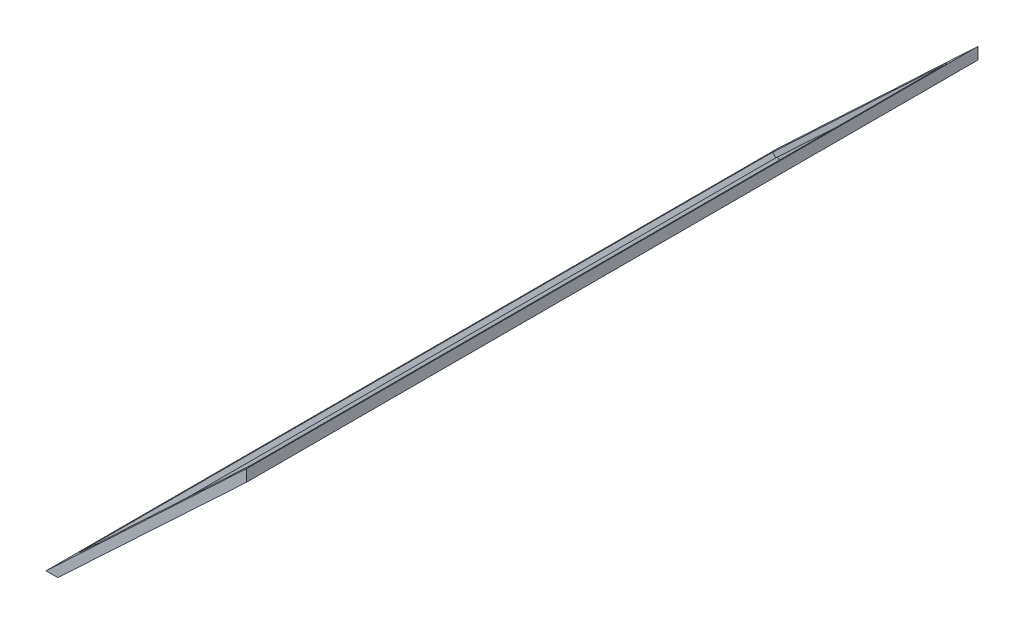
ISO-10303-21;
HEADER;
FILE_DESCRIPTION(('STEP AP214'),'2;1');
FILE_NAME('part.step','',(''),(''),'','','');
FILE_SCHEMA(('AUTOMOTIVE_DESIGN { 1 0 10303 214 1 1 1 1 }'));
ENDSEC;
DATA;
#1=APPLICATION_CONTEXT('core data for automotive mechanical design processes');
#2=APPLICATION_PROTOCOL_DEFINITION('international standard','automotive_design',2000,#1);
#3=PRODUCT_CONTEXT('',#1,'mechanical');
#4=PRODUCT('Part','Part','',(#3));
#5=PRODUCT_RELATED_PRODUCT_CATEGORY('part','',(#4));
#6=PRODUCT_DEFINITION_FORMATION('','',#4);
#7=PRODUCT_DEFINITION_CONTEXT('part definition',#1,'design');
#8=PRODUCT_DEFINITION('design','',#6,#7);
#9=PRODUCT_DEFINITION_SHAPE('','',#8);
#10=(LENGTH_UNIT() NAMED_UNIT(*) SI_UNIT(.MILLI.,.METRE.));
#11=(NAMED_UNIT(*) PLANE_ANGLE_UNIT() SI_UNIT($,.RADIAN.));
#12=(NAMED_UNIT(*) SI_UNIT($,.STERADIAN.) SOLID_ANGLE_UNIT());
#13=UNCERTAINTY_MEASURE_WITH_UNIT(LENGTH_MEASURE(1.E-05),#10,'distance_accuracy_value','');
#14=(GEOMETRIC_REPRESENTATION_CONTEXT(3) GLOBAL_UNCERTAINTY_ASSIGNED_CONTEXT((#13)) GLOBAL_UNIT_ASSIGNED_CONTEXT((#10,
#11,#12)) REPRESENTATION_CONTEXT('',''));
#15=CARTESIAN_POINT('',(0.,0.,0.));
#16=DIRECTION('',(0.,0.,1.));
#17=DIRECTION('',(1.,0.,0.));
#18=AXIS2_PLACEMENT_3D('',#15,#16,#17);
#19=CARTESIAN_POINT('',(0.,0.,620.));
#20=DIRECTION('',(0.,1.,0.));
#21=DIRECTION('',(-1.,0.,0.));
#22=AXIS2_PLACEMENT_3D('',#19,#20,#21);
#23=PLANE('',#22);
#24=DIRECTION('',(1.,0.,0.));
#25=VECTOR('',#24,1.);
#26=CARTESIAN_POINT('',(0.,0.,0.));
#27=LINE('',#26,#25);
#28=CARTESIAN_POINT('',(-10.,0.,0.));
#29=VERTEX_POINT('',#28);
#30=CARTESIAN_POINT('',(0.,0.,0.));
#31=VERTEX_POINT('',#30);
#32=EDGE_CURVE('E180',#29,#31,#27,.T.);
#33=ORIENTED_EDGE('',*,*,#32,.T.);
#34=DIRECTION('',(0.,0.,-1.));
#35=VECTOR('',#34,1.);
#36=CARTESIAN_POINT('',(0.,0.,620.));
#37=LINE('',#36,#35);
#38=CARTESIAN_POINT('',(0.,0.,620.));
#39=VERTEX_POINT('',#38);
#40=EDGE_CURVE('E40',#39,#31,#37,.T.);
#41=ORIENTED_EDGE('',*,*,#40,.F.);
#42=DIRECTION('',(1.,0.,0.));
#43=VECTOR('',#42,1.);
#44=CARTESIAN_POINT('',(0.,0.,620.));
#45=LINE('',#44,#43);
#46=CARTESIAN_POINT('',(-10.,0.,620.));
#47=VERTEX_POINT('',#46);
#48=EDGE_CURVE('E186',#47,#39,#45,.T.);
#49=ORIENTED_EDGE('',*,*,#48,.F.);
#50=DIRECTION('',(0.,0.,-1.));
#51=VECTOR('',#50,1.);
#52=CARTESIAN_POINT('',(-10.,0.,620.));
#53=LINE('',#52,#51);
#54=EDGE_CURVE('E196',#47,#29,#53,.T.);
#55=ORIENTED_EDGE('',*,*,#54,.T.);
#56=EDGE_LOOP('',(#33,#41,#49,#55));
#57=FACE_BOUND('',#56,.T.);
#58=ADVANCED_FACE('F33',(#57),#23,.F.);
#59=CARTESIAN_POINT('',(0.,0.,620.));
#60=DIRECTION('',(-0.68394112888133,0.729537204140085,0.));
#61=DIRECTION('',(-0.729537204140085,-0.68394112888133,0.));
#62=AXIS2_PLACEMENT_3D('',#59,#60,#61);
#63=PLANE('',#62);
#64=DIRECTION('',(-0.729537204140085,-0.68394112888133,0.));
#65=VECTOR('',#64,1.);
#66=CARTESIAN_POINT('',(157.694232948204,147.838343388941,610.));
#67=LINE('',#66,#65);
#68=CARTESIAN_POINT('',(157.694232948204,147.838343388941,610.));
#69=VERTEX_POINT('',#68);
#70=CARTESIAN_POINT('',(1.97312671915553,1.84980629920831,610.));
#71=VERTEX_POINT('',#70);
#72=EDGE_CURVE('E149',#69,#71,#67,.T.);
#73=ORIENTED_EDGE('',*,*,#72,.F.);
#74=DIRECTION('',(0.,0.,1.));
#75=VECTOR('',#74,1.);
#76=CARTESIAN_POINT('',(157.694232948204,147.838343388941,610.));
#77=LINE('',#76,#75);
#78=CARTESIAN_POINT('',(157.694232948204,147.838343388941,10.));
#79=VERTEX_POINT('',#78);
#80=EDGE_CURVE('E47',#79,#69,#77,.T.);
#81=ORIENTED_EDGE('',*,*,#80,.F.);
#82=DIRECTION('',(0.729537204140085,0.68394112888133,0.));
#83=VECTOR('',#82,1.);
#84=CARTESIAN_POINT('',(157.694232948204,147.838343388941,10.));
#85=LINE('',#84,#83);
#86=CARTESIAN_POINT('',(1.97312671915554,1.84980629920832,10.));
#87=VERTEX_POINT('',#86);
#88=EDGE_CURVE('E140',#87,#79,#85,.T.);
#89=ORIENTED_EDGE('',*,*,#88,.F.);
#90=DIRECTION('',(0.,0.,-1.));
#91=VECTOR('',#90,1.);
#92=CARTESIAN_POINT('',(1.97312671915553,1.84980629920831,610.));
#93=LINE('',#92,#91);
#94=EDGE_CURVE('E143',#71,#87,#93,.T.);
#95=ORIENTED_EDGE('',*,*,#94,.F.);
#96=EDGE_LOOP('',(#73,#81,#89,#95));
#97=FACE_BOUND('',#96,.T.);
#98=DIRECTION('',(0.729537204140085,0.68394112888133,0.));
#99=VECTOR('',#98,1.);
#100=CARTESIAN_POINT('',(0.,0.,0.));
#101=LINE('',#100,#99);
#102=CARTESIAN_POINT('',(160.,150.,0.));
#103=VERTEX_POINT('',#102);
#104=EDGE_CURVE('E199',#31,#103,#101,.T.);
#105=ORIENTED_EDGE('',*,*,#104,.T.);
#106=DIRECTION('',(0.,0.,-1.));
#107=VECTOR('',#106,1.);
#108=CARTESIAN_POINT('',(160.,150.,620.));
#109=LINE('',#108,#107);
#110=CARTESIAN_POINT('',(160.,150.,620.));
#111=VERTEX_POINT('',#110);
#112=EDGE_CURVE('E209',#111,#103,#109,.T.);
#113=ORIENTED_EDGE('',*,*,#112,.F.);
#114=DIRECTION('',(0.729537204140085,0.68394112888133,0.));
#115=VECTOR('',#114,1.);
#116=CARTESIAN_POINT('',(0.,0.,620.));
#117=LINE('',#116,#115);
#118=EDGE_CURVE('E189',#39,#111,#117,.T.);
#119=ORIENTED_EDGE('',*,*,#118,.F.);
#120=ORIENTED_EDGE('',*,*,#40,.T.);
#121=EDGE_LOOP('',(#105,#113,#119,#120));
#122=FACE_BOUND('',#121,.T.);
#123=ADVANCED_FACE('F214',(#97,#122),#63,.F.);
#124=CARTESIAN_POINT('',(160.,150.,620.));
#125=DIRECTION('',(-1.,0.,0.));
#126=DIRECTION('',(0.,0.,1.));
#127=AXIS2_PLACEMENT_3D('',#124,#125,#126);
#128=PLANE('',#127);
#129=DIRECTION('',(0.,1.,0.));
#130=VECTOR('',#129,1.);
#131=CARTESIAN_POINT('',(160.,150.,0.));
#132=LINE('',#131,#130);
#133=CARTESIAN_POINT('',(160.,160.,0.));
#134=VERTEX_POINT('',#133);
#135=EDGE_CURVE('E201',#103,#134,#132,.T.);
#136=ORIENTED_EDGE('',*,*,#135,.T.);
#137=DIRECTION('',(0.,0.,-1.));
#138=VECTOR('',#137,1.);
#139=CARTESIAN_POINT('',(160.,160.,620.));
#140=LINE('',#139,#138);
#141=CARTESIAN_POINT('',(160.,160.,620.));
#142=VERTEX_POINT('',#141);
#143=EDGE_CURVE('E206',#142,#134,#140,.T.);
#144=ORIENTED_EDGE('',*,*,#143,.F.);
#145=DIRECTION('',(0.,1.,0.));
#146=VECTOR('',#145,1.);
#147=CARTESIAN_POINT('',(160.,150.,620.));
#148=LINE('',#147,#146);
#149=EDGE_CURVE('E192',#111,#142,#148,.T.);
#150=ORIENTED_EDGE('',*,*,#149,.F.);
#151=ORIENTED_EDGE('',*,*,#112,.T.);
#152=EDGE_LOOP('',(#136,#144,#150,#151));
#153=FACE_BOUND('',#152,.T.);
#154=ADVANCED_FACE('F226',(#153),#128,.F.);
#155=CARTESIAN_POINT('',(-10.,0.,620.));
#156=DIRECTION('',(0.685364699004991,-0.728199992692803,0.));
#157=DIRECTION('',(0.728199992692803,0.685364699004991,0.));
#158=AXIS2_PLACEMENT_3D('',#155,#156,#157);
#159=PLANE('',#158);
#160=DIRECTION('',(-0.728199992692803,-0.685364699004991,0.));
#161=VECTOR('',#160,1.);
#162=CARTESIAN_POINT('',(149.077000109608,149.719529514925,15.));
#163=LINE('',#162,#161);
#164=CARTESIAN_POINT('',(149.077000109608,149.719529514925,15.));
#165=VERTEX_POINT('',#164);
#166=CARTESIAN_POINT('',(0.922999890392041,10.2804704850749,15.));
#167=VERTEX_POINT('',#166);
#168=EDGE_CURVE('E168',#165,#167,#163,.T.);
#169=ORIENTED_EDGE('',*,*,#168,.F.);
#170=DIRECTION('',(0.,0.,-1.));
#171=VECTOR('',#170,1.);
#172=CARTESIAN_POINT('',(149.077000109608,149.719529514925,605.));
#173=LINE('',#172,#171);
#174=CARTESIAN_POINT('',(149.077000109608,149.719529514925,605.));
#175=VERTEX_POINT('',#174);
#176=EDGE_CURVE('E165',#175,#165,#173,.T.);
#177=ORIENTED_EDGE('',*,*,#176,.F.);
#178=DIRECTION('',(0.728199992692803,0.685364699004991,0.));
#179=VECTOR('',#178,1.);
#180=CARTESIAN_POINT('',(149.077000109608,149.719529514925,605.));
#181=LINE('',#180,#179);
#182=CARTESIAN_POINT('',(0.922999890392039,10.2804704850749,605.));
#183=VERTEX_POINT('',#182);
#184=EDGE_CURVE('E174',#183,#175,#181,.T.);
#185=ORIENTED_EDGE('',*,*,#184,.F.);
#186=DIRECTION('',(0.,0.,1.));
#187=VECTOR('',#186,1.);
#188=CARTESIAN_POINT('',(0.922999890392039,10.2804704850749,605.));
#189=LINE('',#188,#187);
#190=EDGE_CURVE('E171',#167,#183,#189,.T.);
#191=ORIENTED_EDGE('',*,*,#190,.F.);
#192=EDGE_LOOP('',(#169,#177,#185,#191));
#193=FACE_BOUND('',#192,.T.);
#194=DIRECTION('',(-0.728199992692803,-0.685364699004991,0.));
#195=VECTOR('',#194,1.);
#196=CARTESIAN_POINT('',(-10.,0.,0.));
#197=LINE('',#196,#195);
#198=EDGE_CURVE('E190',#134,#29,#197,.T.);
#199=ORIENTED_EDGE('',*,*,#198,.T.);
#200=ORIENTED_EDGE('',*,*,#54,.F.);
#201=DIRECTION('',(-0.728199992692803,-0.685364699004991,0.));
#202=VECTOR('',#201,1.);
#203=CARTESIAN_POINT('',(-10.,0.,620.));
#204=LINE('',#203,#202);
#205=EDGE_CURVE('E194',#142,#47,#204,.T.);
#206=ORIENTED_EDGE('',*,*,#205,.F.);
#207=ORIENTED_EDGE('',*,*,#143,.T.);
#208=EDGE_LOOP('',(#199,#200,#206,#207));
#209=FACE_BOUND('',#208,.T.);
#210=ADVANCED_FACE('F230',(#193,#209),#159,.F.);
#211=CARTESIAN_POINT('',(0.,0.,620.));
#212=DIRECTION('',(0.,0.,-1.));
#213=DIRECTION('',(-1.,0.,0.));
#214=AXIS2_PLACEMENT_3D('',#211,#212,#213);
#215=PLANE('',#214);
#216=ORIENTED_EDGE('',*,*,#48,.T.);
#217=ORIENTED_EDGE('',*,*,#118,.T.);
#218=ORIENTED_EDGE('',*,*,#149,.T.);
#219=ORIENTED_EDGE('',*,*,#205,.T.);
#220=EDGE_LOOP('',(#216,#217,#218,#219));
#221=FACE_BOUND('',#220,.T.);
#222=ADVANCED_FACE('F232',(#221),#215,.F.);
#223=CARTESIAN_POINT('',(0.,0.,0.));
#224=DIRECTION('',(0.,0.,-1.));
#225=DIRECTION('',(-1.,0.,0.));
#226=AXIS2_PLACEMENT_3D('',#223,#224,#225);
#227=PLANE('',#226);
#228=ORIENTED_EDGE('',*,*,#32,.F.);
#229=ORIENTED_EDGE('',*,*,#198,.F.);
#230=ORIENTED_EDGE('',*,*,#135,.F.);
#231=ORIENTED_EDGE('',*,*,#104,.F.);
#232=EDGE_LOOP('',(#228,#229,#230,#231));
#233=FACE_BOUND('',#232,.T.);
#234=ADVANCED_FACE('F222',(#233),#227,.T.);
#235=CARTESIAN_POINT('',(228.930211118782,64.8754928176775,605.));
#236=DIRECTION('',(0.728199992692803,0.685364699004991,0.));
#237=DIRECTION('',(-0.685364699004991,0.728199992692803,0.));
#238=AXIS2_PLACEMENT_3D('',#235,#236,#237);
#239=PLANE('',#238);
#240=DIRECTION('',(-0.685364699004991,0.728199992692803,0.));
#241=VECTOR('',#240,1.);
#242=CARTESIAN_POINT('',(228.930211118782,64.8754928176775,15.));
#243=LINE('',#242,#241);
#244=CARTESIAN_POINT('',(152.000823046992,146.612967643954,15.));
#245=VERTEX_POINT('',#244);
#246=EDGE_CURVE('E177',#245,#165,#243,.T.);
#247=ORIENTED_EDGE('',*,*,#246,.F.);
#248=DIRECTION('',(0.,0.,1.));
#249=VECTOR('',#248,1.);
#250=CARTESIAN_POINT('',(152.000823046992,146.612967643954,605.));
#251=LINE('',#250,#249);
#252=CARTESIAN_POINT('',(152.000823046992,146.612967643954,605.));
#253=VERTEX_POINT('',#252);
#254=EDGE_CURVE('E55',#245,#253,#251,.T.);
#255=ORIENTED_EDGE('',*,*,#254,.T.);
#256=DIRECTION('',(-0.685364699004991,0.728199992692803,0.));
#257=VECTOR('',#256,1.);
#258=CARTESIAN_POINT('',(228.930211118782,64.8754928176775,605.));
#259=LINE('',#258,#257);
#260=EDGE_CURVE('E178',#253,#175,#259,.T.);
#261=ORIENTED_EDGE('',*,*,#260,.T.);
#262=ORIENTED_EDGE('',*,*,#176,.T.);
#263=EDGE_LOOP('',(#247,#255,#261,#262));
#264=FACE_BOUND('',#263,.T.);
#265=ADVANCED_FACE('F239',(#264),#239,.F.);
#266=CARTESIAN_POINT('',(228.930211118782,64.8754928176775,605.));
#267=DIRECTION('',(0.,0.,1.));
#268=DIRECTION('',(1.,0.,0.));
#269=AXIS2_PLACEMENT_3D('',#266,#267,#268);
#270=PLANE('',#269);
#271=ORIENTED_EDGE('',*,*,#260,.F.);
#272=DIRECTION('',(-0.729537204140085,-0.68394112888133,0.));
#273=VECTOR('',#272,1.);
#274=CARTESIAN_POINT('',(152.16075940473,146.762907979333,605.));
#275=LINE('',#274,#273);
#276=CARTESIAN_POINT('',(3.57448091560872,7.46327189578214,605.));
#277=VERTEX_POINT('',#276);
#278=EDGE_CURVE('E161',#253,#277,#275,.T.);
#279=ORIENTED_EDGE('',*,*,#278,.T.);
#280=DIRECTION('',(-0.685364699004991,0.728199992692803,0.));
#281=VECTOR('',#280,1.);
#282=CARTESIAN_POINT('',(80.7762108995664,-74.5635662121729,605.));
#283=LINE('',#282,#281);
#284=EDGE_CURVE('E181',#277,#183,#283,.T.);
#285=ORIENTED_EDGE('',*,*,#284,.T.);
#286=ORIENTED_EDGE('',*,*,#184,.T.);
#287=EDGE_LOOP('',(#271,#279,#285,#286));
#288=FACE_BOUND('',#287,.T.);
#289=ADVANCED_FACE('F271',(#288),#270,.F.);
#290=CARTESIAN_POINT('',(80.7762108995664,-74.5635662121729,605.));
#291=DIRECTION('',(-0.728199992692803,-0.685364699004991,0.));
#292=DIRECTION('',(0.685364699004991,-0.728199992692803,0.));
#293=AXIS2_PLACEMENT_3D('',#290,#291,#292);
#294=PLANE('',#293);
#295=ORIENTED_EDGE('',*,*,#284,.F.);
#296=DIRECTION('',(0.,0.,-1.));
#297=VECTOR('',#296,1.);
#298=CARTESIAN_POINT('',(3.57448091560872,7.46327189578214,605.));
#299=LINE('',#298,#297);
#300=CARTESIAN_POINT('',(3.57448091560872,7.46327189578212,15.));
#301=VERTEX_POINT('',#300);
#302=EDGE_CURVE('E155',#277,#301,#299,.T.);
#303=ORIENTED_EDGE('',*,*,#302,.T.);
#304=DIRECTION('',(-0.685364699004991,0.728199992692803,0.));
#305=VECTOR('',#304,1.);
#306=CARTESIAN_POINT('',(80.7762108995664,-74.5635662121729,15.));
#307=LINE('',#306,#305);
#308=EDGE_CURVE('E183',#301,#167,#307,.T.);
#309=ORIENTED_EDGE('',*,*,#308,.T.);
#310=ORIENTED_EDGE('',*,*,#190,.T.);
#311=EDGE_LOOP('',(#295,#303,#309,#310));
#312=FACE_BOUND('',#311,.T.);
#313=ADVANCED_FACE('F274',(#312),#294,.F.);
#314=CARTESIAN_POINT('',(228.930211118782,64.8754928176775,15.));
#315=DIRECTION('',(0.,0.,-1.));
#316=DIRECTION('',(-1.,0.,0.));
#317=AXIS2_PLACEMENT_3D('',#314,#315,#316);
#318=PLANE('',#317);
#319=ORIENTED_EDGE('',*,*,#308,.F.);
#320=DIRECTION('',(0.729537204140085,0.68394112888133,0.));
#321=VECTOR('',#320,1.);
#322=CARTESIAN_POINT('',(152.16075940473,146.762907979333,15.));
#323=LINE('',#322,#321);
#324=EDGE_CURVE('E11',#301,#245,#323,.T.);
#325=ORIENTED_EDGE('',*,*,#324,.T.);
#326=ORIENTED_EDGE('',*,*,#246,.T.);
#327=ORIENTED_EDGE('',*,*,#168,.T.);
#328=EDGE_LOOP('',(#319,#325,#326,#327));
#329=FACE_BOUND('',#328,.T.);
#330=ADVANCED_FACE('F278',(#329),#318,.F.);
#331=CARTESIAN_POINT('',(-2.05182338664398,2.18861161242025,0.));
#332=DIRECTION('',(-0.68394112888133,0.729537204140085,0.));
#333=DIRECTION('',(-0.729537204140085,-0.68394112888133,0.));
#334=AXIS2_PLACEMENT_3D('',#331,#332,#333);
#335=PLANE('',#334);
#336=DIRECTION('',(0.,0.,1.));
#337=VECTOR('',#336,1.);
#338=CARTESIAN_POINT('',(155.64240956156,150.026955001362,610.));
#339=LINE('',#338,#337);
#340=CARTESIAN_POINT('',(155.64240956156,150.026955001362,10.));
#341=VERTEX_POINT('',#340);
#342=CARTESIAN_POINT('',(155.64240956156,150.026955001362,610.));
#343=VERTEX_POINT('',#342);
#344=EDGE_CURVE('E122',#341,#343,#339,.T.);
#345=ORIENTED_EDGE('',*,*,#344,.T.);
#346=DIRECTION('',(-0.729537204140085,-0.68394112888133,0.));
#347=VECTOR('',#346,1.);
#348=CARTESIAN_POINT('',(155.64240956156,150.026955001362,610.));
#349=LINE('',#348,#347);
#350=CARTESIAN_POINT('',(-0.0786966674884613,4.03841791162856,610.));
#351=VERTEX_POINT('',#350);
#352=EDGE_CURVE('E131',#343,#351,#349,.T.);
#353=ORIENTED_EDGE('',*,*,#352,.T.);
#354=DIRECTION('',(0.,0.,-1.));
#355=VECTOR('',#354,1.);
#356=CARTESIAN_POINT('',(-0.0786966674884613,4.03841791162856,610.));
#357=LINE('',#356,#355);
#358=CARTESIAN_POINT('',(-0.078696667488453,4.03841791162857,10.));
#359=VERTEX_POINT('',#358);
#360=EDGE_CURVE('E136',#351,#359,#357,.T.);
#361=ORIENTED_EDGE('',*,*,#360,.T.);
#362=DIRECTION('',(0.729537204140085,0.68394112888133,0.));
#363=VECTOR('',#362,1.);
#364=CARTESIAN_POINT('',(155.64240956156,150.026955001362,10.));
#365=LINE('',#364,#363);
#366=EDGE_CURVE('E128',#359,#341,#365,.T.);
#367=ORIENTED_EDGE('',*,*,#366,.T.);
#368=EDGE_LOOP('',(#345,#353,#361,#367));
#369=FACE_BOUND('',#368,.T.);
#370=ORIENTED_EDGE('',*,*,#324,.F.);
#371=ORIENTED_EDGE('',*,*,#302,.F.);
#372=ORIENTED_EDGE('',*,*,#278,.F.);
#373=ORIENTED_EDGE('',*,*,#254,.F.);
#374=EDGE_LOOP('',(#370,#371,#372,#373));
#375=FACE_BOUND('',#374,.T.);
#376=ADVANCED_FACE('F138',(#369,#375),#335,.F.);
#377=CARTESIAN_POINT('',(155.64240956156,150.026955001362,610.));
#378=DIRECTION('',(0.729537204140085,0.68394112888133,0.));
#379=DIRECTION('',(-0.68394112888133,0.729537204140085,0.));
#380=AXIS2_PLACEMENT_3D('',#377,#378,#379);
#381=PLANE('',#380);
#382=ORIENTED_EDGE('',*,*,#80,.T.);
#383=DIRECTION('',(0.68394112888133,-0.729537204140085,0.));
#384=VECTOR('',#383,1.);
#385=CARTESIAN_POINT('',(155.64240956156,150.026955001362,610.));
#386=LINE('',#385,#384);
#387=EDGE_CURVE('E118',#343,#69,#386,.T.);
#388=ORIENTED_EDGE('',*,*,#387,.F.);
#389=ORIENTED_EDGE('',*,*,#344,.F.);
#390=DIRECTION('',(0.68394112888133,-0.729537204140085,0.));
#391=VECTOR('',#390,1.);
#392=CARTESIAN_POINT('',(155.64240956156,150.026955001362,10.));
#393=LINE('',#392,#391);
#394=EDGE_CURVE('E153',#341,#79,#393,.T.);
#395=ORIENTED_EDGE('',*,*,#394,.T.);
#396=EDGE_LOOP('',(#382,#388,#389,#395));
#397=FACE_BOUND('',#396,.T.);
#398=ADVANCED_FACE('F120',(#397),#381,.F.);
#399=CARTESIAN_POINT('',(155.64240956156,150.026955001362,10.));
#400=DIRECTION('',(0.,0.,-1.));
#401=DIRECTION('',(-1.,0.,0.));
#402=AXIS2_PLACEMENT_3D('',#399,#400,#401);
#403=PLANE('',#402);
#404=ORIENTED_EDGE('',*,*,#88,.T.);
#405=ORIENTED_EDGE('',*,*,#394,.F.);
#406=ORIENTED_EDGE('',*,*,#366,.F.);
#407=DIRECTION('',(0.68394112888133,-0.729537204140085,0.));
#408=VECTOR('',#407,1.);
#409=CARTESIAN_POINT('',(-0.078696667488453,4.03841791162857,10.));
#410=LINE('',#409,#408);
#411=EDGE_CURVE('E156',#359,#87,#410,.T.);
#412=ORIENTED_EDGE('',*,*,#411,.T.);
#413=EDGE_LOOP('',(#404,#405,#406,#412));
#414=FACE_BOUND('',#413,.T.);
#415=ADVANCED_FACE('F258',(#414),#403,.F.);
#416=CARTESIAN_POINT('',(-0.0786966674884613,4.03841791162856,610.));
#417=DIRECTION('',(-0.729537204140085,-0.68394112888133,0.));
#418=DIRECTION('',(0.68394112888133,-0.729537204140085,0.));
#419=AXIS2_PLACEMENT_3D('',#416,#417,#418);
#420=PLANE('',#419);
#421=ORIENTED_EDGE('',*,*,#94,.T.);
#422=ORIENTED_EDGE('',*,*,#411,.F.);
#423=ORIENTED_EDGE('',*,*,#360,.F.);
#424=DIRECTION('',(0.68394112888133,-0.729537204140085,0.));
#425=VECTOR('',#424,1.);
#426=CARTESIAN_POINT('',(-0.0786966674884613,4.03841791162856,610.));
#427=LINE('',#426,#425);
#428=EDGE_CURVE('E127',#351,#71,#427,.T.);
#429=ORIENTED_EDGE('',*,*,#428,.T.);
#430=EDGE_LOOP('',(#421,#422,#423,#429));
#431=FACE_BOUND('',#430,.T.);
#432=ADVANCED_FACE('F256',(#431),#420,.F.);
#433=CARTESIAN_POINT('',(155.64240956156,150.026955001362,610.));
#434=DIRECTION('',(0.,0.,1.));
#435=DIRECTION('',(1.,0.,0.));
#436=AXIS2_PLACEMENT_3D('',#433,#434,#435);
#437=PLANE('',#436);
#438=ORIENTED_EDGE('',*,*,#72,.T.);
#439=ORIENTED_EDGE('',*,*,#428,.F.);
#440=ORIENTED_EDGE('',*,*,#352,.F.);
#441=ORIENTED_EDGE('',*,*,#387,.T.);
#442=EDGE_LOOP('',(#438,#439,#440,#441));
#443=FACE_BOUND('',#442,.T.);
#444=ADVANCED_FACE('F132',(#443),#437,.F.);
#445=CLOSED_SHELL('',(#58,#123,#154,#210,#222,#234,#265,#289,#313,#330,#376,#398,#415,#432,#444));
#446=MANIFOLD_SOLID_BREP('B2',#445);
#447=ADVANCED_BREP_SHAPE_REPRESENTATION('',(#18,#446),#14);
#448=SHAPE_DEFINITION_REPRESENTATION(#9,#447);
ENDSEC;
END-ISO-10303-21;
